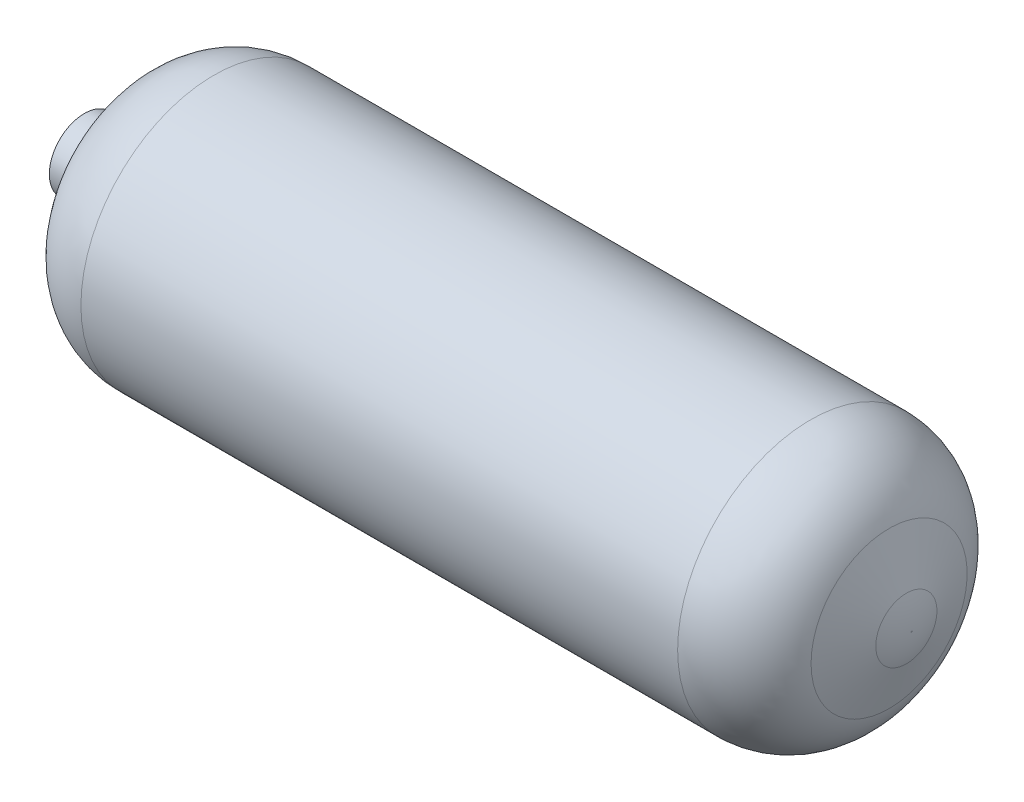
ISO-10303-21;
HEADER;
FILE_DESCRIPTION(('STEP AP214'),'2;1');
FILE_NAME('part.step','',(''),(''),'','','');
FILE_SCHEMA(('AUTOMOTIVE_DESIGN { 1 0 10303 214 1 1 1 1 }'));
ENDSEC;
DATA;
#1=APPLICATION_CONTEXT('core data for automotive mechanical design processes');
#2=APPLICATION_PROTOCOL_DEFINITION('international standard','automotive_design',2000,#1);
#3=PRODUCT_CONTEXT('',#1,'mechanical');
#4=PRODUCT('Part','Part','',(#3));
#5=PRODUCT_RELATED_PRODUCT_CATEGORY('part','',(#4));
#6=PRODUCT_DEFINITION_FORMATION('','',#4);
#7=PRODUCT_DEFINITION_CONTEXT('part definition',#1,'design');
#8=PRODUCT_DEFINITION('design','',#6,#7);
#9=PRODUCT_DEFINITION_SHAPE('','',#8);
#10=(LENGTH_UNIT() NAMED_UNIT(*) SI_UNIT(.MILLI.,.METRE.));
#11=(NAMED_UNIT(*) PLANE_ANGLE_UNIT() SI_UNIT($,.RADIAN.));
#12=(NAMED_UNIT(*) SI_UNIT($,.STERADIAN.) SOLID_ANGLE_UNIT());
#13=UNCERTAINTY_MEASURE_WITH_UNIT(LENGTH_MEASURE(1.E-05),#10,'distance_accuracy_value','');
#14=(GEOMETRIC_REPRESENTATION_CONTEXT(3) GLOBAL_UNCERTAINTY_ASSIGNED_CONTEXT((#13)) GLOBAL_UNIT_ASSIGNED_CONTEXT((#10,
#11,#12)) REPRESENTATION_CONTEXT('',''));
#15=CARTESIAN_POINT('',(0.,0.,0.));
#16=DIRECTION('',(0.,0.,1.));
#17=DIRECTION('',(1.,0.,0.));
#18=AXIS2_PLACEMENT_3D('',#15,#16,#17);
#19=CARTESIAN_POINT('',(-242.271269759622,0.,0.));
#20=DIRECTION('',(1.,0.,0.));
#21=DIRECTION('',(0.,0.,-1.));
#22=AXIS2_PLACEMENT_3D('',#19,#20,#21);
#23=CONICAL_SURFACE('',#22,23.866436766229,1.09955742875643);
#24=CARTESIAN_POINT('',(-226.546463052101,0.,0.));
#25=DIRECTION('',(-1.,0.,0.));
#26=DIRECTION('',(0.,0.,1.));
#27=AXIS2_PLACEMENT_3D('',#24,#25,#26);
#28=CIRCLE('',#27,54.7281076074481);
#29=CARTESIAN_POINT('',(-226.546463052101,0.,54.7281076074481));
#30=VERTEX_POINT('',#29);
#31=EDGE_CURVE('E99',#30,#30,#28,.T.);
#32=ORIENTED_EDGE('',*,*,#31,.T.);
#33=EDGE_LOOP('',(#32));
#34=FACE_BOUND('',#33,.T.);
#35=CARTESIAN_POINT('',(-242.271269759622,0.,0.));
#36=DIRECTION('',(-1.,0.,0.));
#37=DIRECTION('',(0.,0.,1.));
#38=AXIS2_PLACEMENT_3D('',#35,#36,#37);
#39=CIRCLE('',#38,23.866436766229);
#40=CARTESIAN_POINT('',(-242.271269759622,0.,23.866436766229));
#41=VERTEX_POINT('',#40);
#42=EDGE_CURVE('E50',#41,#41,#39,.T.);
#43=ORIENTED_EDGE('',*,*,#42,.F.);
#44=EDGE_LOOP('',(#43));
#45=FACE_BOUND('',#44,.T.);
#46=ADVANCED_FACE('F33',(#34,#45),#23,.T.);
#47=CARTESIAN_POINT('',(-245.166734472183,0.,0.));
#48=DIRECTION('',(-1.,0.,0.));
#49=DIRECTION('',(0.,0.,1.));
#50=AXIS2_PLACEMENT_3D('',#47,#48,#49);
#51=TOROIDAL_SURFACE('',#50,25.3417497253921,3.24965601705214);
#52=CARTESIAN_POINT('',(-245.166734472183,0.,0.));
#53=DIRECTION('',(-1.,0.,0.));
#54=DIRECTION('',(0.,0.,1.));
#55=AXIS2_PLACEMENT_3D('',#52,#53,#54);
#56=CIRCLE('',#55,22.09209370834);
#57=CARTESIAN_POINT('',(-245.166734472183,0.,22.09209370834));
#58=VERTEX_POINT('',#57);
#59=EDGE_CURVE('E74',#58,#58,#56,.T.);
#60=ORIENTED_EDGE('',*,*,#59,.F.);
#61=EDGE_LOOP('',(#60));
#62=FACE_BOUND('',#61,.T.);
#63=ORIENTED_EDGE('',*,*,#42,.T.);
#64=EDGE_LOOP('',(#63));
#65=FACE_BOUND('',#64,.T.);
#66=ADVANCED_FACE('F123',(#62,#65),#51,.F.);
#67=CARTESIAN_POINT('',(-260.719194131512,0.,0.));
#68=DIRECTION('',(-1.,0.,0.));
#69=DIRECTION('',(0.,0.,1.));
#70=AXIS2_PLACEMENT_3D('',#67,#68,#69);
#71=CYLINDRICAL_SURFACE('',#70,22.09209370834);
#72=ORIENTED_EDGE('',*,*,#59,.T.);
#73=EDGE_LOOP('',(#72));
#74=FACE_BOUND('',#73,.T.);
#75=CARTESIAN_POINT('',(-260.719194131512,0.,0.));
#76=DIRECTION('',(-1.,0.,0.));
#77=DIRECTION('',(0.,0.,1.));
#78=AXIS2_PLACEMENT_3D('',#75,#76,#77);
#79=CIRCLE('',#78,22.09209370834);
#80=CARTESIAN_POINT('',(-260.719194131512,0.,22.09209370834));
#81=VERTEX_POINT('',#80);
#82=EDGE_CURVE('E78',#81,#81,#79,.T.);
#83=ORIENTED_EDGE('',*,*,#82,.F.);
#84=EDGE_LOOP('',(#83));
#85=FACE_BOUND('',#84,.T.);
#86=ADVANCED_FACE('F128',(#74,#85),#71,.T.);
#87=CARTESIAN_POINT('',(-260.719194131512,0.,0.));
#88=DIRECTION('',(1.,0.,0.));
#89=DIRECTION('',(0.,0.,-1.));
#90=AXIS2_PLACEMENT_3D('',#87,#88,#89);
#91=PLANE('',#90);
#92=ORIENTED_EDGE('',*,*,#82,.T.);
#93=EDGE_LOOP('',(#92));
#94=FACE_BOUND('',#93,.T.);
#95=ADVANCED_FACE('F273',(#94),#91,.F.);
#96=CARTESIAN_POINT('',(260.719194131512,0.,0.));
#97=DIRECTION('',(-1.,0.,0.));
#98=DIRECTION('',(0.,0.,1.));
#99=AXIS2_PLACEMENT_3D('',#96,#97,#98);
#100=PLANE('',#99);
#101=CARTESIAN_POINT('',(260.719194131512,0.,0.));
#102=DIRECTION('',(-1.,0.,0.));
#103=DIRECTION('',(0.,0.,1.));
#104=AXIS2_PLACEMENT_3D('',#101,#102,#103);
#105=CIRCLE('',#104,0.381787731454405);
#106=CARTESIAN_POINT('',(260.719194131512,0.,0.381787731454405));
#107=VERTEX_POINT('',#106);
#108=EDGE_CURVE('E82',#107,#107,#105,.T.);
#109=ORIENTED_EDGE('',*,*,#108,.F.);
#110=EDGE_LOOP('',(#109));
#111=FACE_BOUND('',#110,.T.);
#112=ADVANCED_FACE('F263',(#111),#100,.F.);
#113=CARTESIAN_POINT('',(205.488959860663,0.,0.));
#114=DIRECTION('',(-1.,0.,0.));
#115=DIRECTION('',(0.,0.,1.));
#116=AXIS2_PLACEMENT_3D('',#113,#114,#115);
#117=DEGENERATE_TOROIDAL_SURFACE('',#116,0.381787731454405,55.23023427085,.T.);
#118=CARTESIAN_POINT('',(257.388403449257,0.,0.));
#119=DIRECTION('',(-1.,0.,0.));
#120=DIRECTION('',(0.,0.,1.));
#121=AXIS2_PLACEMENT_3D('',#118,#119,#120);
#122=CIRCLE('',#121,19.2716403726806);
#123=CARTESIAN_POINT('',(257.388403449257,0.,19.2716403726806));
#124=VERTEX_POINT('',#123);
#125=EDGE_CURVE('E87',#124,#124,#122,.T.);
#126=ORIENTED_EDGE('',*,*,#125,.F.);
#127=EDGE_LOOP('',(#126));
#128=FACE_BOUND('',#127,.T.);
#129=ORIENTED_EDGE('',*,*,#108,.T.);
#130=EDGE_LOOP('',(#129));
#131=FACE_BOUND('',#130,.T.);
#132=ADVANCED_FACE('F253',(#128,#131),#117,.T.);
#133=CARTESIAN_POINT('',(246.499099686017,0.,0.));
#134=DIRECTION('',(-1.,0.,0.));
#135=DIRECTION('',(0.,0.,1.));
#136=AXIS2_PLACEMENT_3D('',#133,#134,#135);
#137=CONICAL_SURFACE('',#136,49.1897565757662,1.22173047639603);
#138=ORIENTED_EDGE('',*,*,#125,.T.);
#139=EDGE_LOOP('',(#138));
#140=FACE_BOUND('',#139,.T.);
#141=CARTESIAN_POINT('',(246.499099686017,0.,0.));
#142=DIRECTION('',(-1.,0.,0.));
#143=DIRECTION('',(0.,0.,1.));
#144=AXIS2_PLACEMENT_3D('',#141,#142,#143);
#145=CIRCLE('',#144,49.1897565757662);
#146=CARTESIAN_POINT('',(246.499099686017,0.,49.1897565757662));
#147=VERTEX_POINT('',#146);
#148=EDGE_CURVE('E90',#147,#147,#145,.T.);
#149=ORIENTED_EDGE('',*,*,#148,.F.);
#150=EDGE_LOOP('',(#149));
#151=FACE_BOUND('',#150,.T.);
#152=ADVANCED_FACE('F119',(#140,#151),#137,.T.);
#153=CARTESIAN_POINT('',(197.041982854532,0.,0.));
#154=DIRECTION('',(-1.,0.,0.));
#155=DIRECTION('',(0.,0.,1.));
#156=AXIS2_PLACEMENT_3D('',#153,#154,#155);
#157=DEGENERATE_TOROIDAL_SURFACE('',#156,31.18883817648,52.63116442281,.T.);
#158=ORIENTED_EDGE('',*,*,#148,.T.);
#159=EDGE_LOOP('',(#158));
#160=FACE_BOUND('',#159,.T.);
#161=CARTESIAN_POINT('',(197.041982854532,0.,0.));
#162=DIRECTION('',(-1.,0.,0.));
#163=DIRECTION('',(0.,0.,1.));
#164=AXIS2_PLACEMENT_3D('',#161,#162,#163);
#165=CIRCLE('',#164,83.82000259929);
#166=CARTESIAN_POINT('',(197.041982854532,0.,83.82000259929));
#167=VERTEX_POINT('',#166);
#168=EDGE_CURVE('E93',#167,#167,#165,.T.);
#169=ORIENTED_EDGE('',*,*,#168,.F.);
#170=EDGE_LOOP('',(#169));
#171=FACE_BOUND('',#170,.T.);
#172=ADVANCED_FACE('F113',(#160,#171),#157,.T.);
#173=CARTESIAN_POINT('',(-260.719194131512,0.,0.));
#174=DIRECTION('',(-1.,0.,0.));
#175=DIRECTION('',(0.,0.,1.));
#176=AXIS2_PLACEMENT_3D('',#173,#174,#175);
#177=CYLINDRICAL_SURFACE('',#176,83.82000259929);
#178=ORIENTED_EDGE('',*,*,#168,.T.);
#179=EDGE_LOOP('',(#178));
#180=FACE_BOUND('',#179,.T.);
#181=CARTESIAN_POINT('',(-179.07280512789,0.,0.));
#182=DIRECTION('',(-1.,0.,0.));
#183=DIRECTION('',(0.,0.,1.));
#184=AXIS2_PLACEMENT_3D('',#181,#182,#183);
#185=CIRCLE('',#184,83.82000259929);
#186=CARTESIAN_POINT('',(-179.07280512789,0.,83.82000259929));
#187=VERTEX_POINT('',#186);
#188=EDGE_CURVE('E96',#187,#187,#185,.T.);
#189=ORIENTED_EDGE('',*,*,#188,.F.);
#190=EDGE_LOOP('',(#189));
#191=FACE_BOUND('',#190,.T.);
#192=ADVANCED_FACE('F108',(#180,#191),#177,.T.);
#193=CARTESIAN_POINT('',(-179.07280512789,0.,0.));
#194=DIRECTION('',(-1.,0.,0.));
#195=DIRECTION('',(0.,0.,1.));
#196=AXIS2_PLACEMENT_3D('',#193,#194,#195);
#197=DEGENERATE_TOROIDAL_SURFACE('',#196,30.53907071447,53.28093188482,.T.);
#198=ORIENTED_EDGE('',*,*,#31,.F.);
#199=EDGE_LOOP('',(#198));
#200=FACE_BOUND('',#199,.T.);
#201=ORIENTED_EDGE('',*,*,#188,.T.);
#202=EDGE_LOOP('',(#201));
#203=FACE_BOUND('',#202,.T.);
#204=ADVANCED_FACE('F105',(#200,#203),#197,.T.);
#205=CLOSED_SHELL('',(#46,#66,#86,#95,#112,#132,#152,#172,#192,#204));
#206=CARTESIAN_POINT('',(-237.292325302457,0.,0.));
#207=DIRECTION('',(1.,0.,0.));
#208=DIRECTION('',(0.,0.,-1.));
#209=AXIS2_PLACEMENT_3D('',#206,#207,#208);
#210=CONICAL_SURFACE('',#209,21.3295378536845,1.09955742875643);
#211=CARTESIAN_POINT('',(-221.567518594936,0.,0.));
#212=DIRECTION('',(1.,0.,0.));
#213=DIRECTION('',(0.,0.,-1.));
#214=AXIS2_PLACEMENT_3D('',#211,#212,#213);
#215=CIRCLE('',#214,52.1912086949035);
#216=CARTESIAN_POINT('',(-221.567518594936,0.,-52.1912086949035));
#217=VERTEX_POINT('',#216);
#218=EDGE_CURVE('E37',#217,#217,#215,.F.);
#219=ORIENTED_EDGE('',*,*,#218,.F.);
#220=EDGE_LOOP('',(#219));
#221=FACE_BOUND('',#220,.T.);
#222=CARTESIAN_POINT('',(-237.292325302457,0.,0.));
#223=DIRECTION('',(-1.,0.,0.));
#224=DIRECTION('',(0.,0.,1.));
#225=AXIS2_PLACEMENT_3D('',#222,#223,#224);
#226=CIRCLE('',#225,21.3295378536845);
#227=CARTESIAN_POINT('',(-237.292325302457,0.,21.3295378536845));
#228=VERTEX_POINT('',#227);
#229=EDGE_CURVE('E66',#228,#228,#226,.T.);
#230=ORIENTED_EDGE('',*,*,#229,.T.);
#231=EDGE_LOOP('',(#230));
#232=FACE_BOUND('',#231,.T.);
#233=ADVANCED_FACE('F133',(#221,#232),#210,.F.);
#234=CARTESIAN_POINT('',(-245.166734472183,0.,0.));
#235=DIRECTION('',(-1.,0.,0.));
#236=DIRECTION('',(0.,0.,1.));
#237=AXIS2_PLACEMENT_3D('',#234,#235,#236);
#238=TOROIDAL_SURFACE('',#237,25.3417497253921,8.83765601705214);
#239=CARTESIAN_POINT('',(-245.166734472183,0.,0.));
#240=DIRECTION('',(-1.,0.,0.));
#241=DIRECTION('',(0.,0.,1.));
#242=AXIS2_PLACEMENT_3D('',#239,#240,#241);
#243=CIRCLE('',#242,16.50409370834);
#244=CARTESIAN_POINT('',(-245.166734472183,0.,16.50409370834));
#245=VERTEX_POINT('',#244);
#246=EDGE_CURVE('E64',#245,#245,#243,.T.);
#247=ORIENTED_EDGE('',*,*,#246,.T.);
#248=EDGE_LOOP('',(#247));
#249=FACE_BOUND('',#248,.T.);
#250=ORIENTED_EDGE('',*,*,#229,.F.);
#251=EDGE_LOOP('',(#250));
#252=FACE_BOUND('',#251,.T.);
#253=ADVANCED_FACE('F136',(#249,#252),#238,.T.);
#254=CARTESIAN_POINT('',(-260.719194131512,0.,0.));
#255=DIRECTION('',(-1.,0.,0.));
#256=DIRECTION('',(0.,0.,1.));
#257=AXIS2_PLACEMENT_3D('',#254,#255,#256);
#258=CYLINDRICAL_SURFACE('',#257,16.50409370834);
#259=ORIENTED_EDGE('',*,*,#246,.F.);
#260=EDGE_LOOP('',(#259));
#261=FACE_BOUND('',#260,.T.);
#262=CARTESIAN_POINT('',(-255.131194131513,0.,0.));
#263=DIRECTION('',(1.,0.,0.));
#264=DIRECTION('',(0.,0.,-1.));
#265=AXIS2_PLACEMENT_3D('',#262,#263,#264);
#266=CIRCLE('',#265,16.50409370834);
#267=CARTESIAN_POINT('',(-255.131194131513,0.,-16.50409370834));
#268=VERTEX_POINT('',#267);
#269=EDGE_CURVE('E61',#268,#268,#266,.F.);
#270=ORIENTED_EDGE('',*,*,#269,.T.);
#271=EDGE_LOOP('',(#270));
#272=FACE_BOUND('',#271,.T.);
#273=ADVANCED_FACE('F141',(#261,#272),#258,.F.);
#274=CARTESIAN_POINT('',(-255.131194131513,0.,0.));
#275=DIRECTION('',(1.,0.,0.));
#276=DIRECTION('',(0.,0.,-1.));
#277=AXIS2_PLACEMENT_3D('',#274,#275,#276);
#278=PLANE('',#277);
#279=ORIENTED_EDGE('',*,*,#269,.F.);
#280=EDGE_LOOP('',(#279));
#281=FACE_BOUND('',#280,.T.);
#282=ADVANCED_FACE('F145',(#281),#278,.T.);
#283=CARTESIAN_POINT('',(255.131194131513,0.,0.));
#284=DIRECTION('',(-1.,0.,0.));
#285=DIRECTION('',(0.,0.,1.));
#286=AXIS2_PLACEMENT_3D('',#283,#284,#285);
#287=PLANE('',#286);
#288=CARTESIAN_POINT('',(255.131194131513,0.,0.));
#289=DIRECTION('',(-1.,0.,0.));
#290=DIRECTION('',(0.,0.,1.));
#291=AXIS2_PLACEMENT_3D('',#288,#289,#290);
#292=CIRCLE('',#291,0.381787731454408);
#293=CARTESIAN_POINT('',(255.131194131513,0.,0.381787731454408));
#294=VERTEX_POINT('',#293);
#295=EDGE_CURVE('E58',#294,#294,#292,.T.);
#296=ORIENTED_EDGE('',*,*,#295,.T.);
#297=EDGE_LOOP('',(#296));
#298=FACE_BOUND('',#297,.T.);
#299=ADVANCED_FACE('F149',(#298),#287,.T.);
#300=CARTESIAN_POINT('',(205.488959860663,0.,0.));
#301=DIRECTION('',(-1.,0.,0.));
#302=DIRECTION('',(0.,0.,1.));
#303=AXIS2_PLACEMENT_3D('',#300,#301,#302);
#304=DEGENERATE_TOROIDAL_SURFACE('',#303,0.381787731454405,49.64223427085,.T.);
#305=CARTESIAN_POINT('',(252.137401084306,0.,0.));
#306=DIRECTION('',(-1.,0.,0.));
#307=DIRECTION('',(0.,0.,1.));
#308=AXIS2_PLACEMENT_3D('',#305,#306,#307);
#309=CIRCLE('',#308,17.3604318117768);
#310=CARTESIAN_POINT('',(252.137401084306,0.,17.3604318117768));
#311=VERTEX_POINT('',#310);
#312=EDGE_CURVE('E55',#311,#311,#309,.T.);
#313=ORIENTED_EDGE('',*,*,#312,.T.);
#314=EDGE_LOOP('',(#313));
#315=FACE_BOUND('',#314,.T.);
#316=ORIENTED_EDGE('',*,*,#295,.F.);
#317=EDGE_LOOP('',(#316));
#318=FACE_BOUND('',#317,.T.);
#319=ADVANCED_FACE('F153',(#315,#318),#304,.F.);
#320=CARTESIAN_POINT('',(241.248097321065,0.,0.));
#321=DIRECTION('',(-1.,0.,0.));
#322=DIRECTION('',(0.,0.,1.));
#323=AXIS2_PLACEMENT_3D('',#320,#321,#322);
#324=CONICAL_SURFACE('',#323,47.2785480148624,1.22173047639603);
#325=ORIENTED_EDGE('',*,*,#312,.F.);
#326=EDGE_LOOP('',(#325));
#327=FACE_BOUND('',#326,.T.);
#328=CARTESIAN_POINT('',(241.248097321065,0.,0.));
#329=DIRECTION('',(-1.,0.,0.));
#330=DIRECTION('',(0.,0.,1.));
#331=AXIS2_PLACEMENT_3D('',#328,#329,#330);
#332=CIRCLE('',#331,47.2785480148624);
#333=CARTESIAN_POINT('',(241.248097321065,0.,47.2785480148624));
#334=VERTEX_POINT('',#333);
#335=EDGE_CURVE('E47',#334,#334,#332,.T.);
#336=ORIENTED_EDGE('',*,*,#335,.T.);
#337=EDGE_LOOP('',(#336));
#338=FACE_BOUND('',#337,.T.);
#339=ADVANCED_FACE('F157',(#327,#338),#324,.F.);
#340=CARTESIAN_POINT('',(197.041982854532,0.,0.));
#341=DIRECTION('',(-1.,0.,0.));
#342=DIRECTION('',(0.,0.,1.));
#343=AXIS2_PLACEMENT_3D('',#340,#341,#342);
#344=DEGENERATE_TOROIDAL_SURFACE('',#343,31.18883817648,47.04316442281,.T.);
#345=ORIENTED_EDGE('',*,*,#335,.F.);
#346=EDGE_LOOP('',(#345));
#347=FACE_BOUND('',#346,.T.);
#348=CARTESIAN_POINT('',(197.041982854532,0.,0.));
#349=DIRECTION('',(-1.,0.,0.));
#350=DIRECTION('',(0.,0.,1.));
#351=AXIS2_PLACEMENT_3D('',#348,#349,#350);
#352=CIRCLE('',#351,78.23200259929);
#353=CARTESIAN_POINT('',(197.041982854532,0.,78.23200259929));
#354=VERTEX_POINT('',#353);
#355=EDGE_CURVE('E42',#354,#354,#352,.T.);
#356=ORIENTED_EDGE('',*,*,#355,.T.);
#357=EDGE_LOOP('',(#356));
#358=FACE_BOUND('',#357,.T.);
#359=ADVANCED_FACE('F161',(#347,#358),#344,.F.);
#360=CARTESIAN_POINT('',(-260.719194131512,0.,0.));
#361=DIRECTION('',(-1.,0.,0.));
#362=DIRECTION('',(0.,0.,1.));
#363=AXIS2_PLACEMENT_3D('',#360,#361,#362);
#364=CYLINDRICAL_SURFACE('',#363,78.23200259929);
#365=ORIENTED_EDGE('',*,*,#355,.F.);
#366=EDGE_LOOP('',(#365));
#367=FACE_BOUND('',#366,.T.);
#368=CARTESIAN_POINT('',(-179.07280512789,0.,0.));
#369=DIRECTION('',(-1.,0.,0.));
#370=DIRECTION('',(0.,0.,1.));
#371=AXIS2_PLACEMENT_3D('',#368,#369,#370);
#372=CIRCLE('',#371,78.23200259929);
#373=CARTESIAN_POINT('',(-179.07280512789,0.,78.23200259929));
#374=VERTEX_POINT('',#373);
#375=EDGE_CURVE('E10',#374,#374,#372,.T.);
#376=ORIENTED_EDGE('',*,*,#375,.T.);
#377=EDGE_LOOP('',(#376));
#378=FACE_BOUND('',#377,.T.);
#379=ADVANCED_FACE('F164',(#367,#378),#364,.F.);
#380=CARTESIAN_POINT('',(-179.07280512789,0.,0.));
#381=DIRECTION('',(-1.,0.,0.));
#382=DIRECTION('',(0.,0.,1.));
#383=AXIS2_PLACEMENT_3D('',#380,#381,#382);
#384=DEGENERATE_TOROIDAL_SURFACE('',#383,30.53907071447,47.69293188482,.T.);
#385=ORIENTED_EDGE('',*,*,#218,.T.);
#386=EDGE_LOOP('',(#385));
#387=FACE_BOUND('',#386,.T.);
#388=ORIENTED_EDGE('',*,*,#375,.F.);
#389=EDGE_LOOP('',(#388));
#390=FACE_BOUND('',#389,.T.);
#391=ADVANCED_FACE('F35',(#387,#390),#384,.F.);
#392=CLOSED_SHELL('',(#233,#253,#273,#282,#299,#319,#339,#359,#379,#391));
#393=ORIENTED_CLOSED_SHELL('',*,#392,.T.);
#394=BREP_WITH_VOIDS('B2',#205,(#393));
#395=ADVANCED_BREP_SHAPE_REPRESENTATION('',(#18,#394),#14);
#396=SHAPE_DEFINITION_REPRESENTATION(#9,#395);
ENDSEC;
END-ISO-10303-21;
